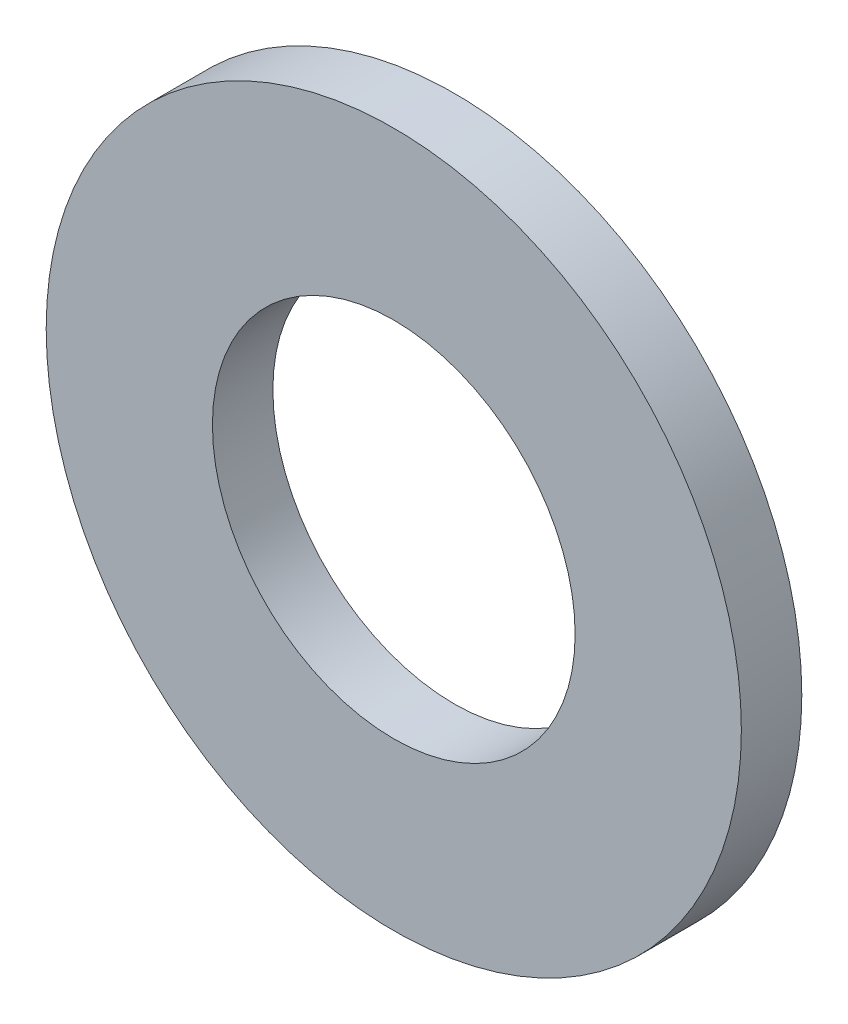
ISO-10303-21;
HEADER;
FILE_DESCRIPTION(('STEP AP214'),'2;1');
FILE_NAME('part.step','',(''),(''),'','','');
FILE_SCHEMA(('AUTOMOTIVE_DESIGN { 1 0 10303 214 1 1 1 1 }'));
ENDSEC;
DATA;
#1=APPLICATION_CONTEXT('core data for automotive mechanical design processes');
#2=APPLICATION_PROTOCOL_DEFINITION('international standard','automotive_design',2000,#1);
#3=PRODUCT_CONTEXT('',#1,'mechanical');
#4=PRODUCT('Part','Part','',(#3));
#5=PRODUCT_RELATED_PRODUCT_CATEGORY('part','',(#4));
#6=PRODUCT_DEFINITION_FORMATION('','',#4);
#7=PRODUCT_DEFINITION_CONTEXT('part definition',#1,'design');
#8=PRODUCT_DEFINITION('design','',#6,#7);
#9=PRODUCT_DEFINITION_SHAPE('','',#8);
#10=(LENGTH_UNIT() NAMED_UNIT(*) SI_UNIT(.MILLI.,.METRE.));
#11=(NAMED_UNIT(*) PLANE_ANGLE_UNIT() SI_UNIT($,.RADIAN.));
#12=(NAMED_UNIT(*) SI_UNIT($,.STERADIAN.) SOLID_ANGLE_UNIT());
#13=UNCERTAINTY_MEASURE_WITH_UNIT(LENGTH_MEASURE(1.E-05),#10,'distance_accuracy_value','');
#14=(GEOMETRIC_REPRESENTATION_CONTEXT(3) GLOBAL_UNCERTAINTY_ASSIGNED_CONTEXT((#13)) GLOBAL_UNIT_ASSIGNED_CONTEXT((#10,
#11,#12)) REPRESENTATION_CONTEXT('',''));
#15=CARTESIAN_POINT('',(0.,0.,0.));
#16=DIRECTION('',(0.,0.,1.));
#17=DIRECTION('',(1.,0.,0.));
#18=AXIS2_PLACEMENT_3D('',#15,#16,#17);
#19=CARTESIAN_POINT('',(0.,0.,2.));
#20=DIRECTION('',(0.,0.,1.));
#21=DIRECTION('',(1.,0.,0.));
#22=AXIS2_PLACEMENT_3D('',#19,#20,#21);
#23=PLANE('',#22);
#24=CARTESIAN_POINT('',(0.,0.,2.));
#25=DIRECTION('',(0.,0.,1.));
#26=DIRECTION('',(1.,0.,0.));
#27=AXIS2_PLACEMENT_3D('',#24,#25,#26);
#28=CIRCLE('',#27,11.5);
#29=CARTESIAN_POINT('',(11.5,0.,2.));
#30=VERTEX_POINT('',#29);
#31=EDGE_CURVE('E10',#30,#30,#28,.T.);
#32=ORIENTED_EDGE('',*,*,#31,.T.);
#33=EDGE_LOOP('',(#32));
#34=FACE_BOUND('',#33,.T.);
#35=CARTESIAN_POINT('',(0.,0.,2.));
#36=DIRECTION('',(0.,0.,1.));
#37=DIRECTION('',(1.,0.,0.));
#38=AXIS2_PLACEMENT_3D('',#35,#36,#37);
#39=CIRCLE('',#38,6.);
#40=CARTESIAN_POINT('',(6.,0.,2.));
#41=VERTEX_POINT('',#40);
#42=EDGE_CURVE('E42',#41,#41,#39,.T.);
#43=ORIENTED_EDGE('',*,*,#42,.F.);
#44=EDGE_LOOP('',(#43));
#45=FACE_BOUND('',#44,.T.);
#46=ADVANCED_FACE('F31',(#34,#45),#23,.T.);
#47=CARTESIAN_POINT('',(0.,0.,0.));
#48=DIRECTION('',(0.,0.,1.));
#49=DIRECTION('',(1.,0.,0.));
#50=AXIS2_PLACEMENT_3D('',#47,#48,#49);
#51=PLANE('',#50);
#52=CARTESIAN_POINT('',(0.,0.,0.));
#53=DIRECTION('',(0.,0.,1.));
#54=DIRECTION('',(1.,0.,0.));
#55=AXIS2_PLACEMENT_3D('',#52,#53,#54);
#56=CIRCLE('',#55,11.5);
#57=CARTESIAN_POINT('',(11.5,0.,0.));
#58=VERTEX_POINT('',#57);
#59=EDGE_CURVE('E35',#58,#58,#56,.T.);
#60=ORIENTED_EDGE('',*,*,#59,.F.);
#61=EDGE_LOOP('',(#60));
#62=FACE_BOUND('',#61,.T.);
#63=CARTESIAN_POINT('',(0.,0.,0.));
#64=DIRECTION('',(0.,0.,1.));
#65=DIRECTION('',(1.,0.,0.));
#66=AXIS2_PLACEMENT_3D('',#63,#64,#65);
#67=CIRCLE('',#66,6.);
#68=CARTESIAN_POINT('',(6.,0.,0.));
#69=VERTEX_POINT('',#68);
#70=EDGE_CURVE('E44',#69,#69,#67,.T.);
#71=ORIENTED_EDGE('',*,*,#70,.T.);
#72=EDGE_LOOP('',(#71));
#73=FACE_BOUND('',#72,.T.);
#74=ADVANCED_FACE('F54',(#62,#73),#51,.F.);
#75=CARTESIAN_POINT('',(0.,0.,2.));
#76=DIRECTION('',(0.,0.,-1.));
#77=DIRECTION('',(-1.,0.,0.));
#78=AXIS2_PLACEMENT_3D('',#75,#76,#77);
#79=CYLINDRICAL_SURFACE('',#78,11.5);
#80=ORIENTED_EDGE('',*,*,#31,.F.);
#81=EDGE_LOOP('',(#80));
#82=FACE_BOUND('',#81,.T.);
#83=ORIENTED_EDGE('',*,*,#59,.T.);
#84=EDGE_LOOP('',(#83));
#85=FACE_BOUND('',#84,.T.);
#86=ADVANCED_FACE('F33',(#82,#85),#79,.T.);
#87=CARTESIAN_POINT('',(0.,0.,2.));
#88=DIRECTION('',(0.,0.,-1.));
#89=DIRECTION('',(-1.,0.,0.));
#90=AXIS2_PLACEMENT_3D('',#87,#88,#89);
#91=CYLINDRICAL_SURFACE('',#90,6.);
#92=ORIENTED_EDGE('',*,*,#42,.T.);
#93=EDGE_LOOP('',(#92));
#94=FACE_BOUND('',#93,.T.);
#95=ORIENTED_EDGE('',*,*,#70,.F.);
#96=EDGE_LOOP('',(#95));
#97=FACE_BOUND('',#96,.T.);
#98=ADVANCED_FACE('F50',(#94,#97),#91,.F.);
#99=CLOSED_SHELL('',(#46,#74,#86,#98));
#100=MANIFOLD_SOLID_BREP('B2',#99);
#101=ADVANCED_BREP_SHAPE_REPRESENTATION('',(#18,#100),#14);
#102=SHAPE_DEFINITION_REPRESENTATION(#9,#101);
ENDSEC;
END-ISO-10303-21;
